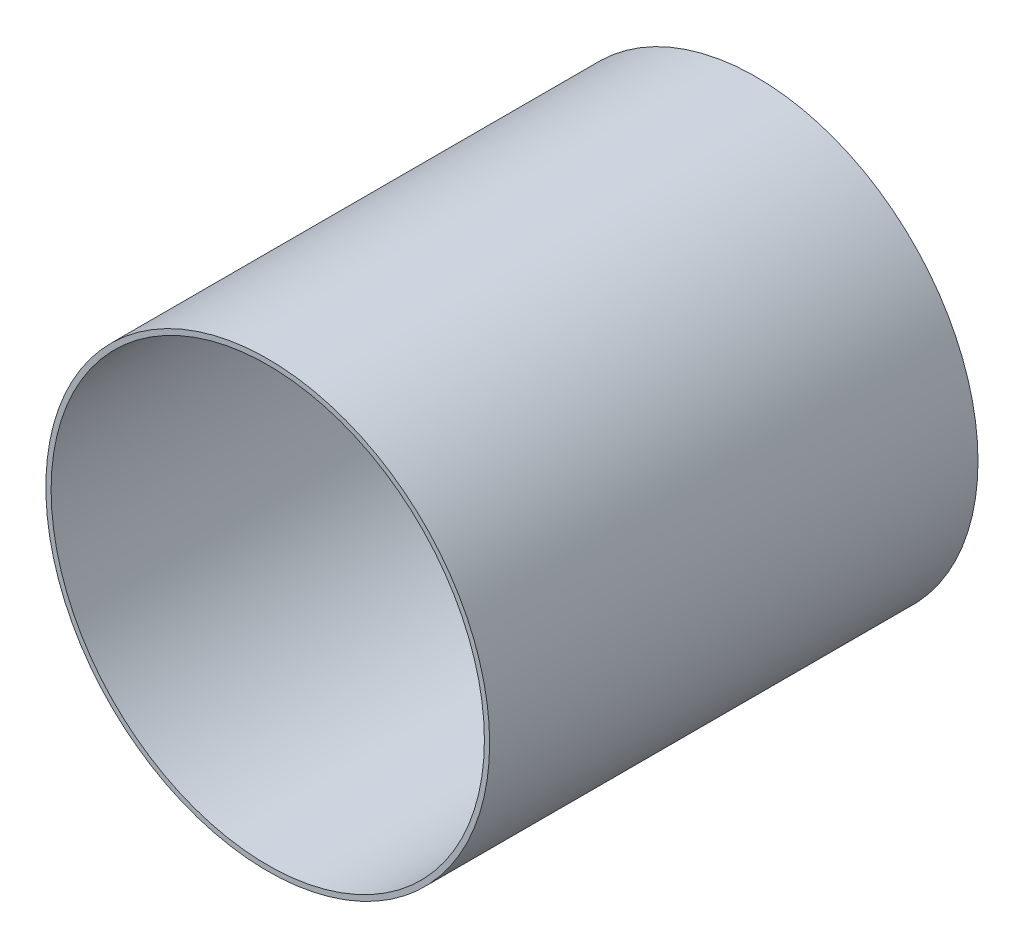
ISO-10303-21;
HEADER;
FILE_DESCRIPTION(('STEP AP214'),'2;1');
FILE_NAME('part.step','',(''),(''),'','','');
FILE_SCHEMA(('AUTOMOTIVE_DESIGN { 1 0 10303 214 1 1 1 1 }'));
ENDSEC;
DATA;
#1=APPLICATION_CONTEXT('core data for automotive mechanical design processes');
#2=APPLICATION_PROTOCOL_DEFINITION('international standard','automotive_design',2000,#1);
#3=PRODUCT_CONTEXT('',#1,'mechanical');
#4=PRODUCT('Part','Part','',(#3));
#5=PRODUCT_RELATED_PRODUCT_CATEGORY('part','',(#4));
#6=PRODUCT_DEFINITION_FORMATION('','',#4);
#7=PRODUCT_DEFINITION_CONTEXT('part definition',#1,'design');
#8=PRODUCT_DEFINITION('design','',#6,#7);
#9=PRODUCT_DEFINITION_SHAPE('','',#8);
#10=(LENGTH_UNIT() NAMED_UNIT(*) SI_UNIT(.MILLI.,.METRE.));
#11=(NAMED_UNIT(*) PLANE_ANGLE_UNIT() SI_UNIT($,.RADIAN.));
#12=(NAMED_UNIT(*) SI_UNIT($,.STERADIAN.) SOLID_ANGLE_UNIT());
#13=UNCERTAINTY_MEASURE_WITH_UNIT(LENGTH_MEASURE(1.E-05),#10,'distance_accuracy_value','');
#14=(GEOMETRIC_REPRESENTATION_CONTEXT(3) GLOBAL_UNCERTAINTY_ASSIGNED_CONTEXT((#13)) GLOBAL_UNIT_ASSIGNED_CONTEXT((#10,
#11,#12)) REPRESENTATION_CONTEXT('',''));
#15=CARTESIAN_POINT('',(0.,0.,0.));
#16=DIRECTION('',(0.,0.,1.));
#17=DIRECTION('',(1.,0.,0.));
#18=AXIS2_PLACEMENT_3D('',#15,#16,#17);
#19=CARTESIAN_POINT('',(0.,0.,69.85));
#20=DIRECTION('',(0.,0.,1.));
#21=DIRECTION('',(1.,0.,0.));
#22=AXIS2_PLACEMENT_3D('',#19,#20,#21);
#23=PLANE('',#22);
#24=CARTESIAN_POINT('',(0.,0.,69.85));
#25=DIRECTION('',(0.,0.,1.));
#26=DIRECTION('',(1.,0.,0.));
#27=AXIS2_PLACEMENT_3D('',#24,#25,#26);
#28=CIRCLE('',#27,63.4746);
#29=CARTESIAN_POINT('',(63.4746,0.,69.85));
#30=VERTEX_POINT('',#29);
#31=EDGE_CURVE('E10',#30,#30,#28,.T.);
#32=ORIENTED_EDGE('',*,*,#31,.T.);
#33=EDGE_LOOP('',(#32));
#34=FACE_BOUND('',#33,.T.);
#35=CARTESIAN_POINT('',(0.,0.,69.85));
#36=DIRECTION('',(0.,0.,1.));
#37=DIRECTION('',(1.,0.,0.));
#38=AXIS2_PLACEMENT_3D('',#35,#36,#37);
#39=CIRCLE('',#38,61.976);
#40=CARTESIAN_POINT('',(61.976,0.,69.85));
#41=VERTEX_POINT('',#40);
#42=EDGE_CURVE('E54',#41,#41,#39,.T.);
#43=ORIENTED_EDGE('',*,*,#42,.F.);
#44=EDGE_LOOP('',(#43));
#45=FACE_BOUND('',#44,.T.);
#46=ADVANCED_FACE('F43',(#34,#45),#23,.T.);
#47=CARTESIAN_POINT('',(0.,0.,-69.85));
#48=DIRECTION('',(0.,0.,1.));
#49=DIRECTION('',(1.,0.,0.));
#50=AXIS2_PLACEMENT_3D('',#47,#48,#49);
#51=PLANE('',#50);
#52=CARTESIAN_POINT('',(0.,0.,-69.85));
#53=DIRECTION('',(0.,0.,1.));
#54=DIRECTION('',(1.,0.,0.));
#55=AXIS2_PLACEMENT_3D('',#52,#53,#54);
#56=CIRCLE('',#55,63.4746);
#57=CARTESIAN_POINT('',(63.4746,0.,-69.85));
#58=VERTEX_POINT('',#57);
#59=EDGE_CURVE('E47',#58,#58,#56,.T.);
#60=ORIENTED_EDGE('',*,*,#59,.F.);
#61=EDGE_LOOP('',(#60));
#62=FACE_BOUND('',#61,.T.);
#63=CARTESIAN_POINT('',(0.,0.,-69.85));
#64=DIRECTION('',(0.,0.,1.));
#65=DIRECTION('',(1.,0.,0.));
#66=AXIS2_PLACEMENT_3D('',#63,#64,#65);
#67=CIRCLE('',#66,61.976);
#68=CARTESIAN_POINT('',(61.976,0.,-69.85));
#69=VERTEX_POINT('',#68);
#70=EDGE_CURVE('E56',#69,#69,#67,.T.);
#71=ORIENTED_EDGE('',*,*,#70,.T.);
#72=EDGE_LOOP('',(#71));
#73=FACE_BOUND('',#72,.T.);
#74=ADVANCED_FACE('F66',(#62,#73),#51,.F.);
#75=CARTESIAN_POINT('',(0.,0.,69.85));
#76=DIRECTION('',(0.,0.,-1.));
#77=DIRECTION('',(-1.,0.,0.));
#78=AXIS2_PLACEMENT_3D('',#75,#76,#77);
#79=CYLINDRICAL_SURFACE('',#78,63.4746);
#80=ORIENTED_EDGE('',*,*,#31,.F.);
#81=EDGE_LOOP('',(#80));
#82=FACE_BOUND('',#81,.T.);
#83=ORIENTED_EDGE('',*,*,#59,.T.);
#84=EDGE_LOOP('',(#83));
#85=FACE_BOUND('',#84,.T.);
#86=ADVANCED_FACE('F45',(#82,#85),#79,.T.);
#87=CARTESIAN_POINT('',(0.,0.,69.85));
#88=DIRECTION('',(0.,0.,-1.));
#89=DIRECTION('',(-1.,0.,0.));
#90=AXIS2_PLACEMENT_3D('',#87,#88,#89);
#91=CYLINDRICAL_SURFACE('',#90,61.976);
#92=ORIENTED_EDGE('',*,*,#42,.T.);
#93=EDGE_LOOP('',(#92));
#94=FACE_BOUND('',#93,.T.);
#95=ORIENTED_EDGE('',*,*,#70,.F.);
#96=EDGE_LOOP('',(#95));
#97=FACE_BOUND('',#96,.T.);
#98=ADVANCED_FACE('F62',(#94,#97),#91,.F.);
#99=CLOSED_SHELL('',(#46,#74,#86,#98));
#100=MANIFOLD_SOLID_BREP('B2',#99);
#101=ADVANCED_BREP_SHAPE_REPRESENTATION('',(#18,#100),#14);
#102=SHAPE_DEFINITION_REPRESENTATION(#9,#101);
ENDSEC;
END-ISO-10303-21;
